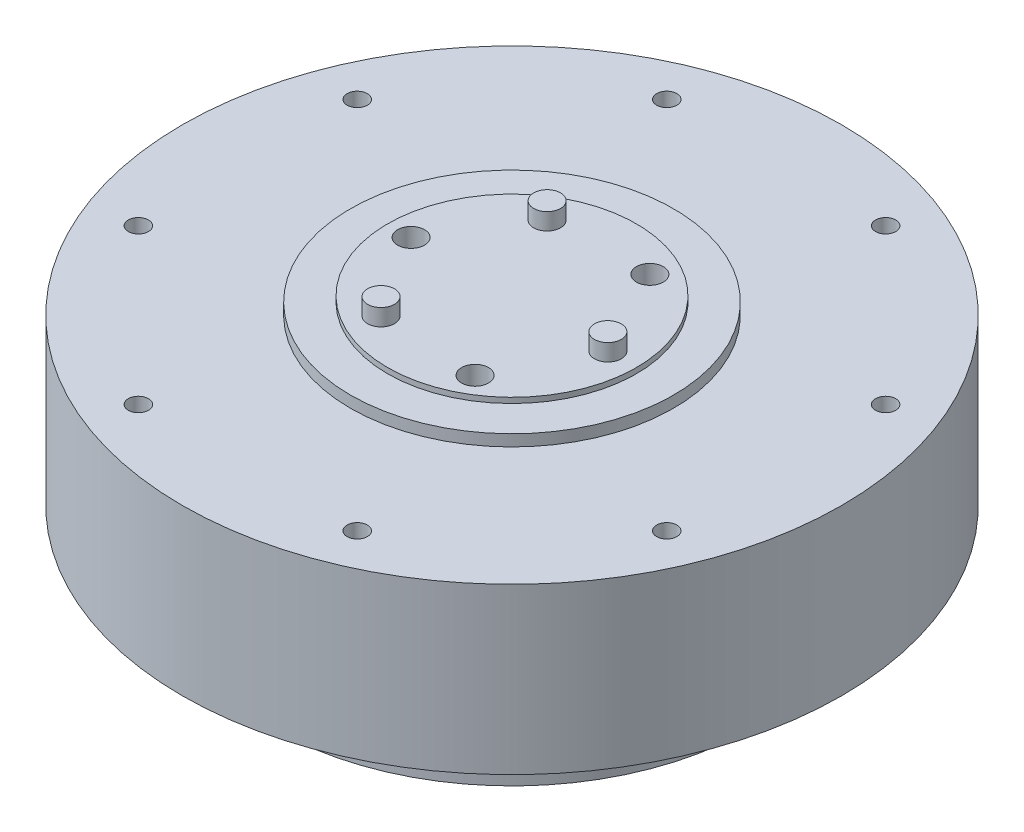
ISO-10303-21;
HEADER;
FILE_DESCRIPTION(('STEP AP214'),'2;1');
FILE_NAME('part.step','',(''),(''),'','','');
FILE_SCHEMA(('AUTOMOTIVE_DESIGN { 1 0 10303 214 1 1 1 1 }'));
ENDSEC;
DATA;
#1=APPLICATION_CONTEXT('core data for automotive mechanical design processes');
#2=APPLICATION_PROTOCOL_DEFINITION('international standard','automotive_design',2000,#1);
#3=PRODUCT_CONTEXT('',#1,'mechanical');
#4=PRODUCT('Part','Part','',(#3));
#5=PRODUCT_RELATED_PRODUCT_CATEGORY('part','',(#4));
#6=PRODUCT_DEFINITION_FORMATION('','',#4);
#7=PRODUCT_DEFINITION_CONTEXT('part definition',#1,'design');
#8=PRODUCT_DEFINITION('design','',#6,#7);
#9=PRODUCT_DEFINITION_SHAPE('','',#8);
#10=(LENGTH_UNIT() NAMED_UNIT(*) SI_UNIT(.MILLI.,.METRE.));
#11=(NAMED_UNIT(*) PLANE_ANGLE_UNIT() SI_UNIT($,.RADIAN.));
#12=(NAMED_UNIT(*) SI_UNIT($,.STERADIAN.) SOLID_ANGLE_UNIT());
#13=UNCERTAINTY_MEASURE_WITH_UNIT(LENGTH_MEASURE(1.E-05),#10,'distance_accuracy_value','');
#14=(GEOMETRIC_REPRESENTATION_CONTEXT(3) GLOBAL_UNCERTAINTY_ASSIGNED_CONTEXT((#13)) GLOBAL_UNIT_ASSIGNED_CONTEXT((#10,
#11,#12)) REPRESENTATION_CONTEXT('',''));
#15=CARTESIAN_POINT('',(0.,0.,0.));
#16=DIRECTION('',(0.,0.,1.));
#17=DIRECTION('',(1.,0.,0.));
#18=AXIS2_PLACEMENT_3D('',#15,#16,#17);
#19=CARTESIAN_POINT('',(0.,24.5,0.));
#20=DIRECTION('',(0.,-1.,0.));
#21=DIRECTION('',(0.,0.,-1.));
#22=AXIS2_PLACEMENT_3D('',#19,#20,#21);
#23=CYLINDRICAL_SURFACE('',#22,49.);
#24=CARTESIAN_POINT('',(0.,24.5,0.));
#25=DIRECTION('',(0.,1.,0.));
#26=DIRECTION('',(0.,0.,1.));
#27=AXIS2_PLACEMENT_3D('',#24,#25,#26);
#28=CIRCLE('',#27,49.);
#29=CARTESIAN_POINT('',(0.,24.5,49.));
#30=VERTEX_POINT('',#29);
#31=EDGE_CURVE('E181',#30,#30,#28,.T.);
#32=ORIENTED_EDGE('',*,*,#31,.F.);
#33=EDGE_LOOP('',(#32));
#34=FACE_BOUND('',#33,.T.);
#35=CARTESIAN_POINT('',(0.,0.,0.));
#36=DIRECTION('',(0.,1.,0.));
#37=DIRECTION('',(0.,0.,1.));
#38=AXIS2_PLACEMENT_3D('',#35,#36,#37);
#39=CIRCLE('',#38,49.);
#40=CARTESIAN_POINT('',(0.,0.,49.));
#41=VERTEX_POINT('',#40);
#42=EDGE_CURVE('E51',#41,#41,#39,.T.);
#43=ORIENTED_EDGE('',*,*,#42,.T.);
#44=EDGE_LOOP('',(#43));
#45=FACE_BOUND('',#44,.T.);
#46=ADVANCED_FACE('F48',(#34,#45),#23,.T.);
#47=CARTESIAN_POINT('',(0.,24.5,0.));
#48=DIRECTION('',(0.,1.,0.));
#49=DIRECTION('',(0.,0.,1.));
#50=AXIS2_PLACEMENT_3D('',#47,#48,#49);
#51=PLANE('',#50);
#52=CARTESIAN_POINT('',(16.2640458755165,24.5,39.2648801317296));
#53=DIRECTION('',(0.,1.,0.));
#54=DIRECTION('',(0.,0.,1.));
#55=AXIS2_PLACEMENT_3D('',#52,#53,#54);
#56=CIRCLE('',#55,1.49999999999999);
#57=CARTESIAN_POINT('',(16.2640458755165,24.5,40.7648801317296));
#58=VERTEX_POINT('',#57);
#59=EDGE_CURVE('E813',#58,#58,#56,.T.);
#60=ORIENTED_EDGE('',*,*,#59,.F.);
#61=EDGE_LOOP('',(#60));
#62=FACE_BOUND('',#61,.T.);
#63=CARTESIAN_POINT('',(-16.2640458755162,24.5,39.2648801317297));
#64=DIRECTION('',(0.,1.,0.));
#65=DIRECTION('',(0.,0.,1.));
#66=AXIS2_PLACEMENT_3D('',#63,#64,#65);
#67=CIRCLE('',#66,1.49999999999999);
#68=CARTESIAN_POINT('',(-16.2640458755162,24.5,40.7648801317297));
#69=VERTEX_POINT('',#68);
#70=EDGE_CURVE('E819',#69,#69,#67,.T.);
#71=ORIENTED_EDGE('',*,*,#70,.F.);
#72=EDGE_LOOP('',(#71));
#73=FACE_BOUND('',#72,.T.);
#74=CARTESIAN_POINT('',(-39.2648801317297,24.5,16.2640458755163));
#75=DIRECTION('',(0.,1.,0.));
#76=DIRECTION('',(0.,0.,1.));
#77=AXIS2_PLACEMENT_3D('',#74,#75,#76);
#78=CIRCLE('',#77,1.49999999999999);
#79=CARTESIAN_POINT('',(-39.2648801317297,24.5,17.7640458755163));
#80=VERTEX_POINT('',#79);
#81=EDGE_CURVE('E825',#80,#80,#78,.T.);
#82=ORIENTED_EDGE('',*,*,#81,.F.);
#83=EDGE_LOOP('',(#82));
#84=FACE_BOUND('',#83,.T.);
#85=CARTESIAN_POINT('',(-39.2648801317299,24.5,-16.2640458755158));
#86=DIRECTION('',(0.,1.,0.));
#87=DIRECTION('',(0.,0.,1.));
#88=AXIS2_PLACEMENT_3D('',#85,#86,#87);
#89=CIRCLE('',#88,1.49999999999999);
#90=CARTESIAN_POINT('',(-39.2648801317299,24.5,-14.7640458755158));
#91=VERTEX_POINT('',#90);
#92=EDGE_CURVE('E794',#91,#91,#89,.T.);
#93=ORIENTED_EDGE('',*,*,#92,.F.);
#94=EDGE_LOOP('',(#93));
#95=FACE_BOUND('',#94,.T.);
#96=CARTESIAN_POINT('',(-16.2640458755168,24.5,-39.2648801317295));
#97=DIRECTION('',(0.,1.,0.));
#98=DIRECTION('',(0.,0.,1.));
#99=AXIS2_PLACEMENT_3D('',#96,#97,#98);
#100=CIRCLE('',#99,1.49999999999999);
#101=CARTESIAN_POINT('',(-16.2640458755168,24.5,-37.7648801317295));
#102=VERTEX_POINT('',#101);
#103=EDGE_CURVE('E795',#102,#102,#100,.T.);
#104=ORIENTED_EDGE('',*,*,#103,.F.);
#105=EDGE_LOOP('',(#104));
#106=FACE_BOUND('',#105,.T.);
#107=CARTESIAN_POINT('',(16.2640458755159,24.5,-39.2648801317298));
#108=DIRECTION('',(0.,1.,0.));
#109=DIRECTION('',(0.,0.,1.));
#110=AXIS2_PLACEMENT_3D('',#107,#108,#109);
#111=CIRCLE('',#110,1.49999999999999);
#112=CARTESIAN_POINT('',(16.2640458755159,24.5,-37.7648801317299));
#113=VERTEX_POINT('',#112);
#114=EDGE_CURVE('E801',#113,#113,#111,.T.);
#115=ORIENTED_EDGE('',*,*,#114,.F.);
#116=EDGE_LOOP('',(#115));
#117=FACE_BOUND('',#116,.T.);
#118=CARTESIAN_POINT('',(39.2648801317297,24.5,-16.2640458755163));
#119=DIRECTION('',(0.,1.,0.));
#120=DIRECTION('',(0.,0.,1.));
#121=AXIS2_PLACEMENT_3D('',#118,#119,#120);
#122=CIRCLE('',#121,1.49999999999999);
#123=CARTESIAN_POINT('',(39.2648801317297,24.5,-14.7640458755164));
#124=VERTEX_POINT('',#123);
#125=EDGE_CURVE('E788',#124,#124,#122,.T.);
#126=ORIENTED_EDGE('',*,*,#125,.F.);
#127=EDGE_LOOP('',(#126));
#128=FACE_BOUND('',#127,.T.);
#129=CARTESIAN_POINT('',(39.2648801317298,24.5,16.2640458755161));
#130=DIRECTION('',(0.,1.,0.));
#131=DIRECTION('',(0.,0.,1.));
#132=AXIS2_PLACEMENT_3D('',#129,#130,#131);
#133=CIRCLE('',#132,1.49999999999999);
#134=CARTESIAN_POINT('',(39.2648801317298,24.5,17.7640458755161));
#135=VERTEX_POINT('',#134);
#136=EDGE_CURVE('E812',#135,#135,#133,.T.);
#137=ORIENTED_EDGE('',*,*,#136,.F.);
#138=EDGE_LOOP('',(#137));
#139=FACE_BOUND('',#138,.T.);
#140=CARTESIAN_POINT('',(0.,24.5,0.));
#141=DIRECTION('',(0.,1.,0.));
#142=DIRECTION('',(0.,0.,1.));
#143=AXIS2_PLACEMENT_3D('',#140,#141,#142);
#144=CIRCLE('',#143,24.);
#145=CARTESIAN_POINT('',(0.,24.5,24.));
#146=VERTEX_POINT('',#145);
#147=EDGE_CURVE('E177',#146,#146,#144,.T.);
#148=ORIENTED_EDGE('',*,*,#147,.F.);
#149=EDGE_LOOP('',(#148));
#150=FACE_BOUND('',#149,.T.);
#151=ORIENTED_EDGE('',*,*,#31,.T.);
#152=EDGE_LOOP('',(#151));
#153=FACE_BOUND('',#152,.T.);
#154=ADVANCED_FACE('F192',(#62,#73,#84,#95,#106,#117,#128,#139,#150,#153),#51,.T.);
#155=CARTESIAN_POINT('',(0.,0.,0.));
#156=DIRECTION('',(0.,1.,0.));
#157=DIRECTION('',(0.,0.,1.));
#158=AXIS2_PLACEMENT_3D('',#155,#156,#157);
#159=PLANE('',#158);
#160=CARTESIAN_POINT('',(-39.2648801317299,0.,-16.2640458755158));
#161=DIRECTION('',(0.,-1.,0.));
#162=DIRECTION('',(0.,0.,-1.));
#163=AXIS2_PLACEMENT_3D('',#160,#161,#162);
#164=CIRCLE('',#163,1.49999999999999);
#165=CARTESIAN_POINT('',(-39.2648801317299,0.,-17.7640458755158));
#166=VERTEX_POINT('',#165);
#167=EDGE_CURVE('E120',#166,#166,#164,.T.);
#168=ORIENTED_EDGE('',*,*,#167,.F.);
#169=EDGE_LOOP('',(#168));
#170=FACE_BOUND('',#169,.T.);
#171=CARTESIAN_POINT('',(-16.2640458755168,0.,-39.2648801317295));
#172=DIRECTION('',(0.,-1.,0.));
#173=DIRECTION('',(0.,0.,-1.));
#174=AXIS2_PLACEMENT_3D('',#171,#172,#173);
#175=CIRCLE('',#174,1.49999999999999);
#176=CARTESIAN_POINT('',(-16.2640458755168,0.,-40.7648801317295));
#177=VERTEX_POINT('',#176);
#178=EDGE_CURVE('E126',#177,#177,#175,.T.);
#179=ORIENTED_EDGE('',*,*,#178,.F.);
#180=EDGE_LOOP('',(#179));
#181=FACE_BOUND('',#180,.T.);
#182=CARTESIAN_POINT('',(16.2640458755159,0.,-39.2648801317298));
#183=DIRECTION('',(0.,-1.,0.));
#184=DIRECTION('',(0.,0.,-1.));
#185=AXIS2_PLACEMENT_3D('',#182,#183,#184);
#186=CIRCLE('',#185,1.49999999999999);
#187=CARTESIAN_POINT('',(16.2640458755159,0.,-40.7648801317298));
#188=VERTEX_POINT('',#187);
#189=EDGE_CURVE('E132',#188,#188,#186,.T.);
#190=ORIENTED_EDGE('',*,*,#189,.F.);
#191=EDGE_LOOP('',(#190));
#192=FACE_BOUND('',#191,.T.);
#193=CARTESIAN_POINT('',(39.2648801317297,0.,-16.2640458755163));
#194=DIRECTION('',(0.,-1.,0.));
#195=DIRECTION('',(0.,0.,-1.));
#196=AXIS2_PLACEMENT_3D('',#193,#194,#195);
#197=CIRCLE('',#196,1.49999999999999);
#198=CARTESIAN_POINT('',(39.2648801317297,0.,-17.7640458755163));
#199=VERTEX_POINT('',#198);
#200=EDGE_CURVE('E138',#199,#199,#197,.T.);
#201=ORIENTED_EDGE('',*,*,#200,.F.);
#202=EDGE_LOOP('',(#201));
#203=FACE_BOUND('',#202,.T.);
#204=CARTESIAN_POINT('',(39.2648801317298,0.,16.2640458755161));
#205=DIRECTION('',(0.,-1.,0.));
#206=DIRECTION('',(0.,0.,-1.));
#207=AXIS2_PLACEMENT_3D('',#204,#205,#206);
#208=CIRCLE('',#207,1.49999999999999);
#209=CARTESIAN_POINT('',(39.2648801317298,0.,14.7640458755161));
#210=VERTEX_POINT('',#209);
#211=EDGE_CURVE('E144',#210,#210,#208,.T.);
#212=ORIENTED_EDGE('',*,*,#211,.F.);
#213=EDGE_LOOP('',(#212));
#214=FACE_BOUND('',#213,.T.);
#215=CARTESIAN_POINT('',(16.2640458755165,0.,39.2648801317296));
#216=DIRECTION('',(0.,-1.,0.));
#217=DIRECTION('',(0.,0.,-1.));
#218=AXIS2_PLACEMENT_3D('',#215,#216,#217);
#219=CIRCLE('',#218,1.49999999999999);
#220=CARTESIAN_POINT('',(16.2640458755165,0.,37.7648801317296));
#221=VERTEX_POINT('',#220);
#222=EDGE_CURVE('E150',#221,#221,#219,.T.);
#223=ORIENTED_EDGE('',*,*,#222,.F.);
#224=EDGE_LOOP('',(#223));
#225=FACE_BOUND('',#224,.T.);
#226=CARTESIAN_POINT('',(-16.2640458755162,0.,39.2648801317297));
#227=DIRECTION('',(0.,-1.,0.));
#228=DIRECTION('',(0.,0.,-1.));
#229=AXIS2_PLACEMENT_3D('',#226,#227,#228);
#230=CIRCLE('',#229,1.49999999999999);
#231=CARTESIAN_POINT('',(-16.2640458755162,0.,37.7648801317298));
#232=VERTEX_POINT('',#231);
#233=EDGE_CURVE('E156',#232,#232,#230,.T.);
#234=ORIENTED_EDGE('',*,*,#233,.F.);
#235=EDGE_LOOP('',(#234));
#236=FACE_BOUND('',#235,.T.);
#237=CARTESIAN_POINT('',(-39.2648801317297,0.,16.2640458755163));
#238=DIRECTION('',(0.,-1.,0.));
#239=DIRECTION('',(0.,0.,-1.));
#240=AXIS2_PLACEMENT_3D('',#237,#238,#239);
#241=CIRCLE('',#240,1.49999999999999);
#242=CARTESIAN_POINT('',(-39.2648801317297,0.,14.7640458755164));
#243=VERTEX_POINT('',#242);
#244=EDGE_CURVE('E162',#243,#243,#241,.T.);
#245=ORIENTED_EDGE('',*,*,#244,.F.);
#246=EDGE_LOOP('',(#245));
#247=FACE_BOUND('',#246,.T.);
#248=CARTESIAN_POINT('',(0.,0.,0.));
#249=DIRECTION('',(0.,-1.,0.));
#250=DIRECTION('',(0.,0.,-1.));
#251=AXIS2_PLACEMENT_3D('',#248,#249,#250);
#252=CIRCLE('',#251,35.5);
#253=CARTESIAN_POINT('',(0.,0.,-35.5));
#254=VERTEX_POINT('',#253);
#255=EDGE_CURVE('E13',#254,#254,#252,.T.);
#256=ORIENTED_EDGE('',*,*,#255,.F.);
#257=EDGE_LOOP('',(#256));
#258=FACE_BOUND('',#257,.T.);
#259=ORIENTED_EDGE('',*,*,#42,.F.);
#260=EDGE_LOOP('',(#259));
#261=FACE_BOUND('',#260,.T.);
#262=ADVANCED_FACE('F189',(#170,#181,#192,#203,#214,#225,#236,#247,#258,#261),#159,.F.);
#263=CARTESIAN_POINT('',(0.,26.2,0.));
#264=DIRECTION('',(0.,-1.,0.));
#265=DIRECTION('',(0.,0.,-1.));
#266=AXIS2_PLACEMENT_3D('',#263,#264,#265);
#267=CYLINDRICAL_SURFACE('',#266,24.);
#268=CARTESIAN_POINT('',(0.,26.2,0.));
#269=DIRECTION('',(0.,1.,0.));
#270=DIRECTION('',(0.,0.,1.));
#271=AXIS2_PLACEMENT_3D('',#268,#269,#270);
#272=CIRCLE('',#271,24.);
#273=CARTESIAN_POINT('',(0.,26.2,24.));
#274=VERTEX_POINT('',#273);
#275=EDGE_CURVE('E174',#274,#274,#272,.T.);
#276=ORIENTED_EDGE('',*,*,#275,.F.);
#277=EDGE_LOOP('',(#276));
#278=FACE_BOUND('',#277,.T.);
#279=ORIENTED_EDGE('',*,*,#147,.T.);
#280=EDGE_LOOP('',(#279));
#281=FACE_BOUND('',#280,.T.);
#282=ADVANCED_FACE('F191',(#278,#281),#267,.T.);
#283=CARTESIAN_POINT('',(0.,26.2,0.));
#284=DIRECTION('',(0.,1.,0.));
#285=DIRECTION('',(0.,0.,1.));
#286=AXIS2_PLACEMENT_3D('',#283,#284,#285);
#287=PLANE('',#286);
#288=CARTESIAN_POINT('',(0.,26.2,0.));
#289=DIRECTION('',(0.,1.,0.));
#290=DIRECTION('',(0.,0.,1.));
#291=AXIS2_PLACEMENT_3D('',#288,#289,#290);
#292=CIRCLE('',#291,18.5);
#293=CARTESIAN_POINT('',(0.,26.2,18.5));
#294=VERTEX_POINT('',#293);
#295=EDGE_CURVE('E56',#294,#294,#292,.T.);
#296=ORIENTED_EDGE('',*,*,#295,.F.);
#297=EDGE_LOOP('',(#296));
#298=FACE_BOUND('',#297,.T.);
#299=ORIENTED_EDGE('',*,*,#275,.T.);
#300=EDGE_LOOP('',(#299));
#301=FACE_BOUND('',#300,.T.);
#302=ADVANCED_FACE('F198',(#298,#301),#287,.T.);
#303=CARTESIAN_POINT('',(0.,27.,0.));
#304=DIRECTION('',(0.,-1.,0.));
#305=DIRECTION('',(0.,0.,-1.));
#306=AXIS2_PLACEMENT_3D('',#303,#304,#305);
#307=CYLINDRICAL_SURFACE('',#306,18.5);
#308=CARTESIAN_POINT('',(0.,27.,0.));
#309=DIRECTION('',(0.,1.,0.));
#310=DIRECTION('',(0.,0.,1.));
#311=AXIS2_PLACEMENT_3D('',#308,#309,#310);
#312=CIRCLE('',#311,18.5);
#313=CARTESIAN_POINT('',(0.,27.,18.5));
#314=VERTEX_POINT('',#313);
#315=EDGE_CURVE('E170',#314,#314,#312,.T.);
#316=ORIENTED_EDGE('',*,*,#315,.F.);
#317=EDGE_LOOP('',(#316));
#318=FACE_BOUND('',#317,.T.);
#319=ORIENTED_EDGE('',*,*,#295,.T.);
#320=EDGE_LOOP('',(#319));
#321=FACE_BOUND('',#320,.T.);
#322=ADVANCED_FACE('F414',(#318,#321),#307,.T.);
#323=CARTESIAN_POINT('',(0.,27.,0.));
#324=DIRECTION('',(0.,1.,0.));
#325=DIRECTION('',(0.,0.,1.));
#326=AXIS2_PLACEMENT_3D('',#323,#324,#325);
#327=PLANE('',#326);
#328=CARTESIAN_POINT('',(14.25,27.,-2.05564731903252E-13));
#329=DIRECTION('',(0.,1.,0.));
#330=DIRECTION('',(-0.866025403784443,0.,-0.499999999999992));
#331=AXIS2_PLACEMENT_3D('',#328,#329,#330);
#332=CIRCLE('',#331,2.);
#333=CARTESIAN_POINT('',(12.5179491924311,27.,-1.00000000000019));
#334=VERTEX_POINT('',#333);
#335=EDGE_CURVE('E774',#334,#334,#332,.T.);
#336=ORIENTED_EDGE('',*,*,#335,.F.);
#337=EDGE_LOOP('',(#336));
#338=FACE_BOUND('',#337,.T.);
#339=CARTESIAN_POINT('',(-7.12499999999988,27.,12.3408620039283));
#340=DIRECTION('',(0.,1.,0.));
#341=DIRECTION('',(0.866025403784436,0.,-0.500000000000004));
#342=AXIS2_PLACEMENT_3D('',#339,#340,#341);
#343=CIRCLE('',#342,2.);
#344=CARTESIAN_POINT('',(-5.39294919243101,27.,11.3408620039283));
#345=VERTEX_POINT('',#344);
#346=EDGE_CURVE('E773',#345,#345,#343,.T.);
#347=ORIENTED_EDGE('',*,*,#346,.F.);
#348=EDGE_LOOP('',(#347));
#349=FACE_BOUND('',#348,.T.);
#350=CARTESIAN_POINT('',(-7.12500000000006,27.,-12.3408620039282));
#351=DIRECTION('',(0.,1.,0.));
#352=DIRECTION('',(0.,0.,1.));
#353=AXIS2_PLACEMENT_3D('',#350,#351,#352);
#354=CIRCLE('',#353,2.);
#355=CARTESIAN_POINT('',(-7.12500000000006,27.,-10.3408620039282));
#356=VERTEX_POINT('',#355);
#357=EDGE_CURVE('E783',#356,#356,#354,.T.);
#358=ORIENTED_EDGE('',*,*,#357,.F.);
#359=EDGE_LOOP('',(#358));
#360=FACE_BOUND('',#359,.T.);
#361=CARTESIAN_POINT('',(7.49999999999988,27.,-12.9903810567666));
#362=DIRECTION('',(0.,1.,0.));
#363=DIRECTION('',(0.,0.,1.));
#364=AXIS2_PLACEMENT_3D('',#361,#362,#363);
#365=CIRCLE('',#364,2.);
#366=CARTESIAN_POINT('',(7.49999999999988,27.,-10.9903810567667));
#367=VERTEX_POINT('',#366);
#368=EDGE_CURVE('E102',#367,#367,#365,.T.);
#369=ORIENTED_EDGE('',*,*,#368,.F.);
#370=EDGE_LOOP('',(#369));
#371=FACE_BOUND('',#370,.T.);
#372=CARTESIAN_POINT('',(7.50000000000006,27.,12.9903810567665));
#373=DIRECTION('',(0.,1.,0.));
#374=DIRECTION('',(0.,0.,1.));
#375=AXIS2_PLACEMENT_3D('',#372,#373,#374);
#376=CIRCLE('',#375,2.);
#377=CARTESIAN_POINT('',(7.50000000000006,27.,14.9903810567665));
#378=VERTEX_POINT('',#377);
#379=EDGE_CURVE('E101',#378,#378,#376,.T.);
#380=ORIENTED_EDGE('',*,*,#379,.F.);
#381=EDGE_LOOP('',(#380));
#382=FACE_BOUND('',#381,.T.);
#383=CARTESIAN_POINT('',(-15.,27.,0.));
#384=DIRECTION('',(0.,1.,0.));
#385=DIRECTION('',(0.,0.,1.));
#386=AXIS2_PLACEMENT_3D('',#383,#384,#385);
#387=CIRCLE('',#386,2.);
#388=CARTESIAN_POINT('',(-15.,27.,2.));
#389=VERTEX_POINT('',#388);
#390=EDGE_CURVE('E114',#389,#389,#387,.T.);
#391=ORIENTED_EDGE('',*,*,#390,.F.);
#392=EDGE_LOOP('',(#391));
#393=FACE_BOUND('',#392,.T.);
#394=ORIENTED_EDGE('',*,*,#315,.T.);
#395=EDGE_LOOP('',(#394));
#396=FACE_BOUND('',#395,.T.);
#397=ADVANCED_FACE('F408',(#338,#349,#360,#371,#382,#393,#396),#327,.T.);
#398=CARTESIAN_POINT('',(0.,-11.,0.));
#399=DIRECTION('',(0.,1.,0.));
#400=DIRECTION('',(0.,0.,1.));
#401=AXIS2_PLACEMENT_3D('',#398,#399,#400);
#402=CYLINDRICAL_SURFACE('',#401,35.5);
#403=CARTESIAN_POINT('',(0.,-11.,0.));
#404=DIRECTION('',(0.,-1.,0.));
#405=DIRECTION('',(0.,0.,-1.));
#406=AXIS2_PLACEMENT_3D('',#403,#404,#405);
#407=CIRCLE('',#406,35.5);
#408=CARTESIAN_POINT('',(0.,-11.,-35.5));
#409=VERTEX_POINT('',#408);
#410=EDGE_CURVE('E168',#409,#409,#407,.T.);
#411=ORIENTED_EDGE('',*,*,#410,.F.);
#412=EDGE_LOOP('',(#411));
#413=FACE_BOUND('',#412,.T.);
#414=ORIENTED_EDGE('',*,*,#255,.T.);
#415=EDGE_LOOP('',(#414));
#416=FACE_BOUND('',#415,.T.);
#417=ADVANCED_FACE('F413',(#413,#416),#402,.T.);
#418=CARTESIAN_POINT('',(0.,-11.,0.));
#419=DIRECTION('',(0.,-1.,0.));
#420=DIRECTION('',(0.,0.,-1.));
#421=AXIS2_PLACEMENT_3D('',#418,#419,#420);
#422=PLANE('',#421);
#423=ORIENTED_EDGE('',*,*,#410,.T.);
#424=EDGE_LOOP('',(#423));
#425=FACE_BOUND('',#424,.T.);
#426=ADVANCED_FACE('F540',(#425),#422,.T.);
#427=CARTESIAN_POINT('',(-39.2648801317297,3.,16.2640458755163));
#428=DIRECTION('',(0.,-1.,0.));
#429=DIRECTION('',(0.,0.,-1.));
#430=AXIS2_PLACEMENT_3D('',#427,#428,#429);
#431=CONICAL_SURFACE('',#430,1.49999999999999,1.02974425867665);
#432=CARTESIAN_POINT('',(-39.2648801317297,3.90129092854134,16.2640458755163));
#433=VERTEX_POINT('',#432);
#434=VERTEX_LOOP('',#433);
#435=FACE_BOUND('',#434,.T.);
#436=CARTESIAN_POINT('',(-39.2648801317297,3.,16.2640458755163));
#437=DIRECTION('',(0.,-1.,0.));
#438=DIRECTION('',(0.,0.,-1.));
#439=AXIS2_PLACEMENT_3D('',#436,#437,#438);
#440=CIRCLE('',#439,1.49999999999999);
#441=CARTESIAN_POINT('',(-39.2648801317297,3.,14.7640458755164));
#442=VERTEX_POINT('',#441);
#443=EDGE_CURVE('E165',#442,#442,#440,.T.);
#444=ORIENTED_EDGE('',*,*,#443,.T.);
#445=EDGE_LOOP('',(#444));
#446=FACE_BOUND('',#445,.T.);
#447=ADVANCED_FACE('F536',(#435,#446),#431,.F.);
#448=CARTESIAN_POINT('',(-39.2648801317297,0.,16.2640458755163));
#449=DIRECTION('',(0.,-1.,0.));
#450=DIRECTION('',(0.,0.,-1.));
#451=AXIS2_PLACEMENT_3D('',#448,#449,#450);
#452=CYLINDRICAL_SURFACE('',#451,1.49999999999999);
#453=ORIENTED_EDGE('',*,*,#443,.F.);
#454=EDGE_LOOP('',(#453));
#455=FACE_BOUND('',#454,.T.);
#456=ORIENTED_EDGE('',*,*,#244,.T.);
#457=EDGE_LOOP('',(#456));
#458=FACE_BOUND('',#457,.T.);
#459=ADVANCED_FACE('F533',(#455,#458),#452,.F.);
#460=CARTESIAN_POINT('',(-16.2640458755162,3.,39.2648801317297));
#461=DIRECTION('',(0.,-1.,0.));
#462=DIRECTION('',(0.,0.,-1.));
#463=AXIS2_PLACEMENT_3D('',#460,#461,#462);
#464=CONICAL_SURFACE('',#463,1.5,1.02974425867665);
#465=CARTESIAN_POINT('',(-16.2640458755162,3.90129092854134,39.2648801317297));
#466=VERTEX_POINT('',#465);
#467=VERTEX_LOOP('',#466);
#468=FACE_BOUND('',#467,.T.);
#469=CARTESIAN_POINT('',(-16.2640458755162,3.,39.2648801317297));
#470=DIRECTION('',(0.,-1.,0.));
#471=DIRECTION('',(0.,0.,-1.));
#472=AXIS2_PLACEMENT_3D('',#469,#470,#471);
#473=CIRCLE('',#472,1.5);
#474=CARTESIAN_POINT('',(-16.2640458755162,3.,37.7648801317297));
#475=VERTEX_POINT('',#474);
#476=EDGE_CURVE('E159',#475,#475,#473,.T.);
#477=ORIENTED_EDGE('',*,*,#476,.T.);
#478=EDGE_LOOP('',(#477));
#479=FACE_BOUND('',#478,.T.);
#480=ADVANCED_FACE('F529',(#468,#479),#464,.F.);
#481=CARTESIAN_POINT('',(-16.2640458755162,0.,39.2648801317297));
#482=DIRECTION('',(0.,-1.,0.));
#483=DIRECTION('',(0.,0.,-1.));
#484=AXIS2_PLACEMENT_3D('',#481,#482,#483);
#485=CYLINDRICAL_SURFACE('',#484,1.49999999999999);
#486=ORIENTED_EDGE('',*,*,#476,.F.);
#487=EDGE_LOOP('',(#486));
#488=FACE_BOUND('',#487,.T.);
#489=ORIENTED_EDGE('',*,*,#233,.T.);
#490=EDGE_LOOP('',(#489));
#491=FACE_BOUND('',#490,.T.);
#492=ADVANCED_FACE('F525',(#488,#491),#485,.F.);
#493=CARTESIAN_POINT('',(16.2640458755165,3.,39.2648801317296));
#494=DIRECTION('',(0.,-1.,0.));
#495=DIRECTION('',(0.,0.,-1.));
#496=AXIS2_PLACEMENT_3D('',#493,#494,#495);
#497=CONICAL_SURFACE('',#496,1.5,1.02974425867665);
#498=CARTESIAN_POINT('',(16.2640458755165,3.90129092854134,39.2648801317296));
#499=VERTEX_POINT('',#498);
#500=VERTEX_LOOP('',#499);
#501=FACE_BOUND('',#500,.T.);
#502=CARTESIAN_POINT('',(16.2640458755165,3.,39.2648801317296));
#503=DIRECTION('',(0.,-1.,0.));
#504=DIRECTION('',(0.,0.,-1.));
#505=AXIS2_PLACEMENT_3D('',#502,#503,#504);
#506=CIRCLE('',#505,1.5);
#507=CARTESIAN_POINT('',(16.2640458755165,3.,37.7648801317296));
#508=VERTEX_POINT('',#507);
#509=EDGE_CURVE('E153',#508,#508,#506,.T.);
#510=ORIENTED_EDGE('',*,*,#509,.T.);
#511=EDGE_LOOP('',(#510));
#512=FACE_BOUND('',#511,.T.);
#513=ADVANCED_FACE('F521',(#501,#512),#497,.F.);
#514=CARTESIAN_POINT('',(16.2640458755165,0.,39.2648801317296));
#515=DIRECTION('',(0.,-1.,0.));
#516=DIRECTION('',(0.,0.,-1.));
#517=AXIS2_PLACEMENT_3D('',#514,#515,#516);
#518=CYLINDRICAL_SURFACE('',#517,1.49999999999999);
#519=ORIENTED_EDGE('',*,*,#509,.F.);
#520=EDGE_LOOP('',(#519));
#521=FACE_BOUND('',#520,.T.);
#522=ORIENTED_EDGE('',*,*,#222,.T.);
#523=EDGE_LOOP('',(#522));
#524=FACE_BOUND('',#523,.T.);
#525=ADVANCED_FACE('F517',(#521,#524),#518,.F.);
#526=CARTESIAN_POINT('',(39.2648801317298,3.,16.2640458755161));
#527=DIRECTION('',(0.,-1.,0.));
#528=DIRECTION('',(0.,0.,-1.));
#529=AXIS2_PLACEMENT_3D('',#526,#527,#528);
#530=CONICAL_SURFACE('',#529,1.49999999999999,1.02974425867665);
#531=CARTESIAN_POINT('',(39.2648801317298,3.90129092854134,16.2640458755161));
#532=VERTEX_POINT('',#531);
#533=VERTEX_LOOP('',#532);
#534=FACE_BOUND('',#533,.T.);
#535=CARTESIAN_POINT('',(39.2648801317298,3.,16.2640458755161));
#536=DIRECTION('',(0.,-1.,0.));
#537=DIRECTION('',(0.,0.,-1.));
#538=AXIS2_PLACEMENT_3D('',#535,#536,#537);
#539=CIRCLE('',#538,1.49999999999999);
#540=CARTESIAN_POINT('',(39.2648801317298,3.,14.7640458755161));
#541=VERTEX_POINT('',#540);
#542=EDGE_CURVE('E147',#541,#541,#539,.T.);
#543=ORIENTED_EDGE('',*,*,#542,.T.);
#544=EDGE_LOOP('',(#543));
#545=FACE_BOUND('',#544,.T.);
#546=ADVANCED_FACE('F513',(#534,#545),#530,.F.);
#547=CARTESIAN_POINT('',(39.2648801317298,0.,16.2640458755161));
#548=DIRECTION('',(0.,-1.,0.));
#549=DIRECTION('',(0.,0.,-1.));
#550=AXIS2_PLACEMENT_3D('',#547,#548,#549);
#551=CYLINDRICAL_SURFACE('',#550,1.49999999999999);
#552=ORIENTED_EDGE('',*,*,#542,.F.);
#553=EDGE_LOOP('',(#552));
#554=FACE_BOUND('',#553,.T.);
#555=ORIENTED_EDGE('',*,*,#211,.T.);
#556=EDGE_LOOP('',(#555));
#557=FACE_BOUND('',#556,.T.);
#558=ADVANCED_FACE('F509',(#554,#557),#551,.F.);
#559=CARTESIAN_POINT('',(39.2648801317297,3.,-16.2640458755163));
#560=DIRECTION('',(0.,-1.,0.));
#561=DIRECTION('',(0.,0.,-1.));
#562=AXIS2_PLACEMENT_3D('',#559,#560,#561);
#563=CONICAL_SURFACE('',#562,1.49999999999999,1.02974425867665);
#564=CARTESIAN_POINT('',(39.2648801317297,3.90129092854134,-16.2640458755163));
#565=VERTEX_POINT('',#564);
#566=VERTEX_LOOP('',#565);
#567=FACE_BOUND('',#566,.T.);
#568=CARTESIAN_POINT('',(39.2648801317297,3.,-16.2640458755163));
#569=DIRECTION('',(0.,-1.,0.));
#570=DIRECTION('',(0.,0.,-1.));
#571=AXIS2_PLACEMENT_3D('',#568,#569,#570);
#572=CIRCLE('',#571,1.49999999999999);
#573=CARTESIAN_POINT('',(39.2648801317297,3.,-17.7640458755163));
#574=VERTEX_POINT('',#573);
#575=EDGE_CURVE('E141',#574,#574,#572,.T.);
#576=ORIENTED_EDGE('',*,*,#575,.T.);
#577=EDGE_LOOP('',(#576));
#578=FACE_BOUND('',#577,.T.);
#579=ADVANCED_FACE('F505',(#567,#578),#563,.F.);
#580=CARTESIAN_POINT('',(39.2648801317297,0.,-16.2640458755163));
#581=DIRECTION('',(0.,-1.,0.));
#582=DIRECTION('',(0.,0.,-1.));
#583=AXIS2_PLACEMENT_3D('',#580,#581,#582);
#584=CYLINDRICAL_SURFACE('',#583,1.49999999999999);
#585=ORIENTED_EDGE('',*,*,#575,.F.);
#586=EDGE_LOOP('',(#585));
#587=FACE_BOUND('',#586,.T.);
#588=ORIENTED_EDGE('',*,*,#200,.T.);
#589=EDGE_LOOP('',(#588));
#590=FACE_BOUND('',#589,.T.);
#591=ADVANCED_FACE('F501',(#587,#590),#584,.F.);
#592=CARTESIAN_POINT('',(16.2640458755159,3.,-39.2648801317298));
#593=DIRECTION('',(0.,-1.,0.));
#594=DIRECTION('',(0.,0.,-1.));
#595=AXIS2_PLACEMENT_3D('',#592,#593,#594);
#596=CONICAL_SURFACE('',#595,1.5,1.02974425867665);
#597=CARTESIAN_POINT('',(16.2640458755159,3.90129092854134,-39.2648801317298));
#598=VERTEX_POINT('',#597);
#599=VERTEX_LOOP('',#598);
#600=FACE_BOUND('',#599,.T.);
#601=CARTESIAN_POINT('',(16.2640458755159,3.,-39.2648801317298));
#602=DIRECTION('',(0.,-1.,0.));
#603=DIRECTION('',(0.,0.,-1.));
#604=AXIS2_PLACEMENT_3D('',#601,#602,#603);
#605=CIRCLE('',#604,1.5);
#606=CARTESIAN_POINT('',(16.2640458755159,3.,-40.7648801317298));
#607=VERTEX_POINT('',#606);
#608=EDGE_CURVE('E135',#607,#607,#605,.T.);
#609=ORIENTED_EDGE('',*,*,#608,.T.);
#610=EDGE_LOOP('',(#609));
#611=FACE_BOUND('',#610,.T.);
#612=ADVANCED_FACE('F497',(#600,#611),#596,.F.);
#613=CARTESIAN_POINT('',(16.2640458755159,0.,-39.2648801317298));
#614=DIRECTION('',(0.,-1.,0.));
#615=DIRECTION('',(0.,0.,-1.));
#616=AXIS2_PLACEMENT_3D('',#613,#614,#615);
#617=CYLINDRICAL_SURFACE('',#616,1.49999999999999);
#618=ORIENTED_EDGE('',*,*,#608,.F.);
#619=EDGE_LOOP('',(#618));
#620=FACE_BOUND('',#619,.T.);
#621=ORIENTED_EDGE('',*,*,#189,.T.);
#622=EDGE_LOOP('',(#621));
#623=FACE_BOUND('',#622,.T.);
#624=ADVANCED_FACE('F493',(#620,#623),#617,.F.);
#625=CARTESIAN_POINT('',(-16.2640458755168,3.,-39.2648801317295));
#626=DIRECTION('',(0.,-1.,0.));
#627=DIRECTION('',(0.,0.,-1.));
#628=AXIS2_PLACEMENT_3D('',#625,#626,#627);
#629=CONICAL_SURFACE('',#628,1.5,1.02974425867665);
#630=CARTESIAN_POINT('',(-16.2640458755168,3.90129092854134,-39.2648801317295));
#631=VERTEX_POINT('',#630);
#632=VERTEX_LOOP('',#631);
#633=FACE_BOUND('',#632,.T.);
#634=CARTESIAN_POINT('',(-16.2640458755168,3.,-39.2648801317295));
#635=DIRECTION('',(0.,-1.,0.));
#636=DIRECTION('',(0.,0.,-1.));
#637=AXIS2_PLACEMENT_3D('',#634,#635,#636);
#638=CIRCLE('',#637,1.5);
#639=CARTESIAN_POINT('',(-16.2640458755168,3.,-40.7648801317295));
#640=VERTEX_POINT('',#639);
#641=EDGE_CURVE('E129',#640,#640,#638,.T.);
#642=ORIENTED_EDGE('',*,*,#641,.T.);
#643=EDGE_LOOP('',(#642));
#644=FACE_BOUND('',#643,.T.);
#645=ADVANCED_FACE('F489',(#633,#644),#629,.F.);
#646=CARTESIAN_POINT('',(-16.2640458755168,0.,-39.2648801317295));
#647=DIRECTION('',(0.,-1.,0.));
#648=DIRECTION('',(0.,0.,-1.));
#649=AXIS2_PLACEMENT_3D('',#646,#647,#648);
#650=CYLINDRICAL_SURFACE('',#649,1.49999999999999);
#651=ORIENTED_EDGE('',*,*,#641,.F.);
#652=EDGE_LOOP('',(#651));
#653=FACE_BOUND('',#652,.T.);
#654=ORIENTED_EDGE('',*,*,#178,.T.);
#655=EDGE_LOOP('',(#654));
#656=FACE_BOUND('',#655,.T.);
#657=ADVANCED_FACE('F485',(#653,#656),#650,.F.);
#658=CARTESIAN_POINT('',(-39.2648801317299,3.,-16.2640458755158));
#659=DIRECTION('',(0.,-1.,0.));
#660=DIRECTION('',(0.,0.,-1.));
#661=AXIS2_PLACEMENT_3D('',#658,#659,#660);
#662=CONICAL_SURFACE('',#661,1.49999999999999,1.02974425867665);
#663=CARTESIAN_POINT('',(-39.2648801317299,3.90129092854134,-16.2640458755158));
#664=VERTEX_POINT('',#663);
#665=VERTEX_LOOP('',#664);
#666=FACE_BOUND('',#665,.T.);
#667=CARTESIAN_POINT('',(-39.2648801317299,3.,-16.2640458755158));
#668=DIRECTION('',(0.,-1.,0.));
#669=DIRECTION('',(0.,0.,-1.));
#670=AXIS2_PLACEMENT_3D('',#667,#668,#669);
#671=CIRCLE('',#670,1.49999999999999);
#672=CARTESIAN_POINT('',(-39.2648801317299,3.,-17.7640458755158));
#673=VERTEX_POINT('',#672);
#674=EDGE_CURVE('E123',#673,#673,#671,.T.);
#675=ORIENTED_EDGE('',*,*,#674,.T.);
#676=EDGE_LOOP('',(#675));
#677=FACE_BOUND('',#676,.T.);
#678=ADVANCED_FACE('F481',(#666,#677),#662,.F.);
#679=CARTESIAN_POINT('',(-39.2648801317299,0.,-16.2640458755158));
#680=DIRECTION('',(0.,-1.,0.));
#681=DIRECTION('',(0.,0.,-1.));
#682=AXIS2_PLACEMENT_3D('',#679,#680,#681);
#683=CYLINDRICAL_SURFACE('',#682,1.49999999999999);
#684=ORIENTED_EDGE('',*,*,#674,.F.);
#685=EDGE_LOOP('',(#684));
#686=FACE_BOUND('',#685,.T.);
#687=ORIENTED_EDGE('',*,*,#167,.T.);
#688=EDGE_LOOP('',(#687));
#689=FACE_BOUND('',#688,.T.);
#690=ADVANCED_FACE('F477',(#686,#689),#683,.F.);
#691=CARTESIAN_POINT('',(-15.,22.5,0.));
#692=DIRECTION('',(0.,1.,0.));
#693=DIRECTION('',(0.,0.,1.));
#694=AXIS2_PLACEMENT_3D('',#691,#692,#693);
#695=CONICAL_SURFACE('',#694,2.,1.02974425867665);
#696=CARTESIAN_POINT('',(-15.,21.2982787619449,0.));
#697=VERTEX_POINT('',#696);
#698=VERTEX_LOOP('',#697);
#699=FACE_BOUND('',#698,.T.);
#700=CARTESIAN_POINT('',(-15.,22.5,0.));
#701=DIRECTION('',(0.,1.,0.));
#702=DIRECTION('',(0.,0.,1.));
#703=AXIS2_PLACEMENT_3D('',#700,#701,#702);
#704=CIRCLE('',#703,2.);
#705=CARTESIAN_POINT('',(-15.,22.5,2.));
#706=VERTEX_POINT('',#705);
#707=EDGE_CURVE('E117',#706,#706,#704,.T.);
#708=ORIENTED_EDGE('',*,*,#707,.T.);
#709=EDGE_LOOP('',(#708));
#710=FACE_BOUND('',#709,.T.);
#711=ADVANCED_FACE('F473',(#699,#710),#695,.F.);
#712=CARTESIAN_POINT('',(-15.,27.,0.));
#713=DIRECTION('',(0.,1.,0.));
#714=DIRECTION('',(0.,0.,1.));
#715=AXIS2_PLACEMENT_3D('',#712,#713,#714);
#716=CYLINDRICAL_SURFACE('',#715,2.);
#717=ORIENTED_EDGE('',*,*,#707,.F.);
#718=EDGE_LOOP('',(#717));
#719=FACE_BOUND('',#718,.T.);
#720=ORIENTED_EDGE('',*,*,#390,.T.);
#721=EDGE_LOOP('',(#720));
#722=FACE_BOUND('',#721,.T.);
#723=ADVANCED_FACE('F469',(#719,#722),#716,.F.);
#724=CARTESIAN_POINT('',(7.50000000000006,22.5,12.9903810567665));
#725=DIRECTION('',(0.,1.,0.));
#726=DIRECTION('',(0.,0.,1.));
#727=AXIS2_PLACEMENT_3D('',#724,#725,#726);
#728=CONICAL_SURFACE('',#727,2.,1.02974425867665);
#729=CARTESIAN_POINT('',(7.50000000000006,21.2982787619449,12.9903810567665));
#730=VERTEX_POINT('',#729);
#731=VERTEX_LOOP('',#730);
#732=FACE_BOUND('',#731,.T.);
#733=CARTESIAN_POINT('',(7.50000000000006,22.5,12.9903810567665));
#734=DIRECTION('',(0.,1.,0.));
#735=DIRECTION('',(0.,0.,1.));
#736=AXIS2_PLACEMENT_3D('',#733,#734,#735);
#737=CIRCLE('',#736,2.);
#738=CARTESIAN_POINT('',(7.50000000000006,22.5,14.9903810567665));
#739=VERTEX_POINT('',#738);
#740=EDGE_CURVE('E105',#739,#739,#737,.T.);
#741=ORIENTED_EDGE('',*,*,#740,.T.);
#742=EDGE_LOOP('',(#741));
#743=FACE_BOUND('',#742,.T.);
#744=ADVANCED_FACE('F465',(#732,#743),#728,.F.);
#745=CARTESIAN_POINT('',(7.50000000000006,27.,12.9903810567665));
#746=DIRECTION('',(0.,1.,0.));
#747=DIRECTION('',(0.,0.,1.));
#748=AXIS2_PLACEMENT_3D('',#745,#746,#747);
#749=CYLINDRICAL_SURFACE('',#748,2.);
#750=ORIENTED_EDGE('',*,*,#740,.F.);
#751=EDGE_LOOP('',(#750));
#752=FACE_BOUND('',#751,.T.);
#753=ORIENTED_EDGE('',*,*,#379,.T.);
#754=EDGE_LOOP('',(#753));
#755=FACE_BOUND('',#754,.T.);
#756=ADVANCED_FACE('F95',(#752,#755),#749,.F.);
#757=CARTESIAN_POINT('',(7.49999999999988,22.5,-12.9903810567666));
#758=DIRECTION('',(0.,1.,0.));
#759=DIRECTION('',(0.,0.,1.));
#760=AXIS2_PLACEMENT_3D('',#757,#758,#759);
#761=CONICAL_SURFACE('',#760,2.,1.02974425867665);
#762=CARTESIAN_POINT('',(7.49999999999988,21.2982787619449,-12.9903810567666));
#763=VERTEX_POINT('',#762);
#764=VERTEX_LOOP('',#763);
#765=FACE_BOUND('',#764,.T.);
#766=CARTESIAN_POINT('',(7.49999999999988,22.5,-12.9903810567666));
#767=DIRECTION('',(0.,1.,0.));
#768=DIRECTION('',(0.,0.,1.));
#769=AXIS2_PLACEMENT_3D('',#766,#767,#768);
#770=CIRCLE('',#769,2.);
#771=CARTESIAN_POINT('',(7.49999999999988,22.5,-10.9903810567667));
#772=VERTEX_POINT('',#771);
#773=EDGE_CURVE('E99',#772,#772,#770,.T.);
#774=ORIENTED_EDGE('',*,*,#773,.T.);
#775=EDGE_LOOP('',(#774));
#776=FACE_BOUND('',#775,.T.);
#777=ADVANCED_FACE('F91',(#765,#776),#761,.F.);
#778=CARTESIAN_POINT('',(7.49999999999988,27.,-12.9903810567666));
#779=DIRECTION('',(0.,1.,0.));
#780=DIRECTION('',(0.,0.,1.));
#781=AXIS2_PLACEMENT_3D('',#778,#779,#780);
#782=CYLINDRICAL_SURFACE('',#781,2.);
#783=ORIENTED_EDGE('',*,*,#773,.F.);
#784=EDGE_LOOP('',(#783));
#785=FACE_BOUND('',#784,.T.);
#786=ORIENTED_EDGE('',*,*,#368,.T.);
#787=EDGE_LOOP('',(#786));
#788=FACE_BOUND('',#787,.T.);
#789=ADVANCED_FACE('F94',(#785,#788),#782,.F.);
#790=CARTESIAN_POINT('',(39.2648801317298,21.,16.2640458755161));
#791=DIRECTION('',(0.,1.,0.));
#792=DIRECTION('',(0.,0.,1.));
#793=AXIS2_PLACEMENT_3D('',#790,#791,#792);
#794=CYLINDRICAL_SURFACE('',#793,1.49999999999999);
#795=CARTESIAN_POINT('',(39.2648801317298,21.,16.2640458755161));
#796=DIRECTION('',(0.,1.,0.));
#797=DIRECTION('',(0.,0.,1.));
#798=AXIS2_PLACEMENT_3D('',#795,#796,#797);
#799=CIRCLE('',#798,1.49999999999999);
#800=CARTESIAN_POINT('',(39.2648801317298,21.,17.7640458755161));
#801=VERTEX_POINT('',#800);
#802=EDGE_CURVE('E108',#801,#801,#799,.T.);
#803=ORIENTED_EDGE('',*,*,#802,.F.);
#804=EDGE_LOOP('',(#803));
#805=FACE_BOUND('',#804,.T.);
#806=ORIENTED_EDGE('',*,*,#136,.T.);
#807=EDGE_LOOP('',(#806));
#808=FACE_BOUND('',#807,.T.);
#809=ADVANCED_FACE('F225',(#805,#808),#794,.F.);
#810=CARTESIAN_POINT('',(39.2648801317298,21.,16.2640458755161));
#811=DIRECTION('',(0.,1.,0.));
#812=DIRECTION('',(0.,0.,1.));
#813=AXIS2_PLACEMENT_3D('',#810,#811,#812);
#814=PLANE('',#813);
#815=ORIENTED_EDGE('',*,*,#802,.T.);
#816=EDGE_LOOP('',(#815));
#817=FACE_BOUND('',#816,.T.);
#818=ADVANCED_FACE('F230',(#817),#814,.T.);
#819=CARTESIAN_POINT('',(39.2648801317297,21.,-16.2640458755163));
#820=DIRECTION('',(0.,1.,0.));
#821=DIRECTION('',(0.,0.,1.));
#822=AXIS2_PLACEMENT_3D('',#819,#820,#821);
#823=CYLINDRICAL_SURFACE('',#822,1.49999999999999);
#824=CARTESIAN_POINT('',(39.2648801317297,21.,-16.2640458755163));
#825=DIRECTION('',(0.,1.,0.));
#826=DIRECTION('',(0.,0.,1.));
#827=AXIS2_PLACEMENT_3D('',#824,#825,#826);
#828=CIRCLE('',#827,1.49999999999999);
#829=CARTESIAN_POINT('',(39.2648801317297,21.,-14.7640458755164));
#830=VERTEX_POINT('',#829);
#831=EDGE_CURVE('E804',#830,#830,#828,.T.);
#832=ORIENTED_EDGE('',*,*,#831,.F.);
#833=EDGE_LOOP('',(#832));
#834=FACE_BOUND('',#833,.T.);
#835=ORIENTED_EDGE('',*,*,#125,.T.);
#836=EDGE_LOOP('',(#835));
#837=FACE_BOUND('',#836,.T.);
#838=ADVANCED_FACE('F240',(#834,#837),#823,.F.);
#839=CARTESIAN_POINT('',(39.2648801317297,21.,-16.2640458755163));
#840=DIRECTION('',(0.,1.,0.));
#841=DIRECTION('',(0.,0.,1.));
#842=AXIS2_PLACEMENT_3D('',#839,#840,#841);
#843=PLANE('',#842);
#844=ORIENTED_EDGE('',*,*,#831,.T.);
#845=EDGE_LOOP('',(#844));
#846=FACE_BOUND('',#845,.T.);
#847=ADVANCED_FACE('F250',(#846),#843,.T.);
#848=CARTESIAN_POINT('',(16.2640458755159,21.,-39.2648801317298));
#849=DIRECTION('',(0.,1.,0.));
#850=DIRECTION('',(0.,0.,1.));
#851=AXIS2_PLACEMENT_3D('',#848,#849,#850);
#852=CYLINDRICAL_SURFACE('',#851,1.49999999999999);
#853=CARTESIAN_POINT('',(16.2640458755159,21.,-39.2648801317298));
#854=DIRECTION('',(0.,1.,0.));
#855=DIRECTION('',(0.,0.,1.));
#856=AXIS2_PLACEMENT_3D('',#853,#854,#855);
#857=CIRCLE('',#856,1.49999999999999);
#858=CARTESIAN_POINT('',(16.2640458755159,21.,-37.7648801317299));
#859=VERTEX_POINT('',#858);
#860=EDGE_CURVE('E798',#859,#859,#857,.T.);
#861=ORIENTED_EDGE('',*,*,#860,.F.);
#862=EDGE_LOOP('',(#861));
#863=FACE_BOUND('',#862,.T.);
#864=ORIENTED_EDGE('',*,*,#114,.T.);
#865=EDGE_LOOP('',(#864));
#866=FACE_BOUND('',#865,.T.);
#867=ADVANCED_FACE('F260',(#863,#866),#852,.F.);
#868=CARTESIAN_POINT('',(16.2640458755159,21.,-39.2648801317298));
#869=DIRECTION('',(0.,1.,0.));
#870=DIRECTION('',(0.,0.,1.));
#871=AXIS2_PLACEMENT_3D('',#868,#869,#870);
#872=PLANE('',#871);
#873=ORIENTED_EDGE('',*,*,#860,.T.);
#874=EDGE_LOOP('',(#873));
#875=FACE_BOUND('',#874,.T.);
#876=ADVANCED_FACE('F270',(#875),#872,.T.);
#877=CARTESIAN_POINT('',(-16.2640458755168,21.,-39.2648801317295));
#878=DIRECTION('',(0.,1.,0.));
#879=DIRECTION('',(0.,0.,1.));
#880=AXIS2_PLACEMENT_3D('',#877,#878,#879);
#881=CYLINDRICAL_SURFACE('',#880,1.49999999999999);
#882=CARTESIAN_POINT('',(-16.2640458755168,21.,-39.2648801317295));
#883=DIRECTION('',(0.,1.,0.));
#884=DIRECTION('',(0.,0.,1.));
#885=AXIS2_PLACEMENT_3D('',#882,#883,#884);
#886=CIRCLE('',#885,1.49999999999999);
#887=CARTESIAN_POINT('',(-16.2640458755168,21.,-37.7648801317295));
#888=VERTEX_POINT('',#887);
#889=EDGE_CURVE('E791',#888,#888,#886,.T.);
#890=ORIENTED_EDGE('',*,*,#889,.F.);
#891=EDGE_LOOP('',(#890));
#892=FACE_BOUND('',#891,.T.);
#893=ORIENTED_EDGE('',*,*,#103,.T.);
#894=EDGE_LOOP('',(#893));
#895=FACE_BOUND('',#894,.T.);
#896=ADVANCED_FACE('F280',(#892,#895),#881,.F.);
#897=CARTESIAN_POINT('',(-16.2640458755168,21.,-39.2648801317295));
#898=DIRECTION('',(0.,1.,0.));
#899=DIRECTION('',(0.,0.,1.));
#900=AXIS2_PLACEMENT_3D('',#897,#898,#899);
#901=PLANE('',#900);
#902=ORIENTED_EDGE('',*,*,#889,.T.);
#903=EDGE_LOOP('',(#902));
#904=FACE_BOUND('',#903,.T.);
#905=ADVANCED_FACE('F290',(#904),#901,.T.);
#906=CARTESIAN_POINT('',(-39.2648801317299,21.,-16.2640458755158));
#907=DIRECTION('',(0.,1.,0.));
#908=DIRECTION('',(0.,0.,1.));
#909=AXIS2_PLACEMENT_3D('',#906,#907,#908);
#910=CYLINDRICAL_SURFACE('',#909,1.49999999999999);
#911=CARTESIAN_POINT('',(-39.2648801317299,21.,-16.2640458755158));
#912=DIRECTION('',(0.,1.,0.));
#913=DIRECTION('',(0.,0.,1.));
#914=AXIS2_PLACEMENT_3D('',#911,#912,#913);
#915=CIRCLE('',#914,1.49999999999999);
#916=CARTESIAN_POINT('',(-39.2648801317299,21.,-14.7640458755158));
#917=VERTEX_POINT('',#916);
#918=EDGE_CURVE('E828',#917,#917,#915,.T.);
#919=ORIENTED_EDGE('',*,*,#918,.F.);
#920=EDGE_LOOP('',(#919));
#921=FACE_BOUND('',#920,.T.);
#922=ORIENTED_EDGE('',*,*,#92,.T.);
#923=EDGE_LOOP('',(#922));
#924=FACE_BOUND('',#923,.T.);
#925=ADVANCED_FACE('F300',(#921,#924),#910,.F.);
#926=CARTESIAN_POINT('',(-39.2648801317299,21.,-16.2640458755158));
#927=DIRECTION('',(0.,1.,0.));
#928=DIRECTION('',(0.,0.,1.));
#929=AXIS2_PLACEMENT_3D('',#926,#927,#928);
#930=PLANE('',#929);
#931=ORIENTED_EDGE('',*,*,#918,.T.);
#932=EDGE_LOOP('',(#931));
#933=FACE_BOUND('',#932,.T.);
#934=ADVANCED_FACE('F310',(#933),#930,.T.);
#935=CARTESIAN_POINT('',(-39.2648801317297,21.,16.2640458755163));
#936=DIRECTION('',(0.,1.,0.));
#937=DIRECTION('',(0.,0.,1.));
#938=AXIS2_PLACEMENT_3D('',#935,#936,#937);
#939=CYLINDRICAL_SURFACE('',#938,1.49999999999999);
#940=CARTESIAN_POINT('',(-39.2648801317297,21.,16.2640458755163));
#941=DIRECTION('',(0.,1.,0.));
#942=DIRECTION('',(0.,0.,1.));
#943=AXIS2_PLACEMENT_3D('',#940,#941,#942);
#944=CIRCLE('',#943,1.49999999999999);
#945=CARTESIAN_POINT('',(-39.2648801317297,21.,17.7640458755163));
#946=VERTEX_POINT('',#945);
#947=EDGE_CURVE('E822',#946,#946,#944,.T.);
#948=ORIENTED_EDGE('',*,*,#947,.F.);
#949=EDGE_LOOP('',(#948));
#950=FACE_BOUND('',#949,.T.);
#951=ORIENTED_EDGE('',*,*,#81,.T.);
#952=EDGE_LOOP('',(#951));
#953=FACE_BOUND('',#952,.T.);
#954=ADVANCED_FACE('F320',(#950,#953),#939,.F.);
#955=CARTESIAN_POINT('',(-39.2648801317297,21.,16.2640458755163));
#956=DIRECTION('',(0.,1.,0.));
#957=DIRECTION('',(0.,0.,1.));
#958=AXIS2_PLACEMENT_3D('',#955,#956,#957);
#959=PLANE('',#958);
#960=ORIENTED_EDGE('',*,*,#947,.T.);
#961=EDGE_LOOP('',(#960));
#962=FACE_BOUND('',#961,.T.);
#963=ADVANCED_FACE('F330',(#962),#959,.T.);
#964=CARTESIAN_POINT('',(-16.2640458755162,21.,39.2648801317297));
#965=DIRECTION('',(0.,1.,0.));
#966=DIRECTION('',(0.,0.,1.));
#967=AXIS2_PLACEMENT_3D('',#964,#965,#966);
#968=CYLINDRICAL_SURFACE('',#967,1.49999999999999);
#969=CARTESIAN_POINT('',(-16.2640458755162,21.,39.2648801317297));
#970=DIRECTION('',(0.,1.,0.));
#971=DIRECTION('',(0.,0.,1.));
#972=AXIS2_PLACEMENT_3D('',#969,#970,#971);
#973=CIRCLE('',#972,1.49999999999999);
#974=CARTESIAN_POINT('',(-16.2640458755162,21.,40.7648801317297));
#975=VERTEX_POINT('',#974);
#976=EDGE_CURVE('E816',#975,#975,#973,.T.);
#977=ORIENTED_EDGE('',*,*,#976,.F.);
#978=EDGE_LOOP('',(#977));
#979=FACE_BOUND('',#978,.T.);
#980=ORIENTED_EDGE('',*,*,#70,.T.);
#981=EDGE_LOOP('',(#980));
#982=FACE_BOUND('',#981,.T.);
#983=ADVANCED_FACE('F340',(#979,#982),#968,.F.);
#984=CARTESIAN_POINT('',(-16.2640458755162,21.,39.2648801317297));
#985=DIRECTION('',(0.,1.,0.));
#986=DIRECTION('',(0.,0.,1.));
#987=AXIS2_PLACEMENT_3D('',#984,#985,#986);
#988=PLANE('',#987);
#989=ORIENTED_EDGE('',*,*,#976,.T.);
#990=EDGE_LOOP('',(#989));
#991=FACE_BOUND('',#990,.T.);
#992=ADVANCED_FACE('F350',(#991),#988,.T.);
#993=CARTESIAN_POINT('',(16.2640458755165,21.,39.2648801317296));
#994=DIRECTION('',(0.,1.,0.));
#995=DIRECTION('',(0.,0.,1.));
#996=AXIS2_PLACEMENT_3D('',#993,#994,#995);
#997=CYLINDRICAL_SURFACE('',#996,1.49999999999999);
#998=CARTESIAN_POINT('',(16.2640458755165,21.,39.2648801317296));
#999=DIRECTION('',(0.,1.,0.));
#1000=DIRECTION('',(0.,0.,1.));
#1001=AXIS2_PLACEMENT_3D('',#998,#999,#1000);
#1002=CIRCLE('',#1001,1.49999999999999);
#1003=CARTESIAN_POINT('',(16.2640458755165,21.,40.7648801317296));
#1004=VERTEX_POINT('',#1003);
#1005=EDGE_CURVE('E809',#1004,#1004,#1002,.T.);
#1006=ORIENTED_EDGE('',*,*,#1005,.F.);
#1007=EDGE_LOOP('',(#1006));
#1008=FACE_BOUND('',#1007,.T.);
#1009=ORIENTED_EDGE('',*,*,#59,.T.);
#1010=EDGE_LOOP('',(#1009));
#1011=FACE_BOUND('',#1010,.T.);
#1012=ADVANCED_FACE('F360',(#1008,#1011),#997,.F.);
#1013=CARTESIAN_POINT('',(16.2640458755165,21.,39.2648801317296));
#1014=DIRECTION('',(0.,1.,0.));
#1015=DIRECTION('',(0.,0.,1.));
#1016=AXIS2_PLACEMENT_3D('',#1013,#1014,#1015);
#1017=PLANE('',#1016);
#1018=ORIENTED_EDGE('',*,*,#1005,.T.);
#1019=EDGE_LOOP('',(#1018));
#1020=FACE_BOUND('',#1019,.T.);
#1021=ADVANCED_FACE('F370',(#1020),#1017,.T.);
#1022=CARTESIAN_POINT('',(-7.12500000000006,29.5,-12.3408620039282));
#1023=DIRECTION('',(0.,-1.,0.));
#1024=DIRECTION('',(0.,0.,-1.));
#1025=AXIS2_PLACEMENT_3D('',#1022,#1023,#1024);
#1026=CYLINDRICAL_SURFACE('',#1025,2.);
#1027=CARTESIAN_POINT('',(-7.12500000000006,29.5,-12.3408620039282));
#1028=DIRECTION('',(0.,1.,0.));
#1029=DIRECTION('',(0.,0.,1.));
#1030=AXIS2_PLACEMENT_3D('',#1027,#1028,#1029);
#1031=CIRCLE('',#1030,2.);
#1032=CARTESIAN_POINT('',(-7.12500000000006,29.5,-10.3408620039282));
#1033=VERTEX_POINT('',#1032);
#1034=EDGE_CURVE('E785',#1033,#1033,#1031,.T.);
#1035=ORIENTED_EDGE('',*,*,#1034,.F.);
#1036=EDGE_LOOP('',(#1035));
#1037=FACE_BOUND('',#1036,.T.);
#1038=ORIENTED_EDGE('',*,*,#357,.T.);
#1039=EDGE_LOOP('',(#1038));
#1040=FACE_BOUND('',#1039,.T.);
#1041=ADVANCED_FACE('F380',(#1037,#1040),#1026,.T.);
#1042=CARTESIAN_POINT('',(-7.12500000000006,29.5,-12.3408620039282));
#1043=DIRECTION('',(0.,1.,0.));
#1044=DIRECTION('',(0.,0.,1.));
#1045=AXIS2_PLACEMENT_3D('',#1042,#1043,#1044);
#1046=PLANE('',#1045);
#1047=ORIENTED_EDGE('',*,*,#1034,.T.);
#1048=EDGE_LOOP('',(#1047));
#1049=FACE_BOUND('',#1048,.T.);
#1050=ADVANCED_FACE('F390',(#1049),#1046,.T.);
#1051=CARTESIAN_POINT('',(-7.12499999999988,29.5,12.3408620039283));
#1052=DIRECTION('',(0.,-1.,0.));
#1053=DIRECTION('',(0.,0.,-1.));
#1054=AXIS2_PLACEMENT_3D('',#1051,#1052,#1053);
#1055=CYLINDRICAL_SURFACE('',#1054,2.);
#1056=CARTESIAN_POINT('',(-7.12499999999988,29.5,12.3408620039283));
#1057=DIRECTION('',(0.,1.,0.));
#1058=DIRECTION('',(0.866025403784436,0.,-0.500000000000004));
#1059=AXIS2_PLACEMENT_3D('',#1056,#1057,#1058);
#1060=CIRCLE('',#1059,2.);
#1061=CARTESIAN_POINT('',(-5.39294919243101,29.5,11.3408620039283));
#1062=VERTEX_POINT('',#1061);
#1063=EDGE_CURVE('E777',#1062,#1062,#1060,.T.);
#1064=ORIENTED_EDGE('',*,*,#1063,.F.);
#1065=EDGE_LOOP('',(#1064));
#1066=FACE_BOUND('',#1065,.T.);
#1067=ORIENTED_EDGE('',*,*,#346,.T.);
#1068=EDGE_LOOP('',(#1067));
#1069=FACE_BOUND('',#1068,.T.);
#1070=ADVANCED_FACE('F400',(#1066,#1069),#1055,.T.);
#1071=CARTESIAN_POINT('',(-7.12499999999988,29.5,12.3408620039283));
#1072=DIRECTION('',(0.,1.,0.));
#1073=DIRECTION('',(0.866025403784436,0.,-0.500000000000004));
#1074=AXIS2_PLACEMENT_3D('',#1071,#1072,#1073);
#1075=PLANE('',#1074);
#1076=ORIENTED_EDGE('',*,*,#1063,.T.);
#1077=EDGE_LOOP('',(#1076));
#1078=FACE_BOUND('',#1077,.T.);
#1079=ADVANCED_FACE('F426',(#1078),#1075,.T.);
#1080=CARTESIAN_POINT('',(14.25,29.5,-2.05564731903252E-13));
#1081=DIRECTION('',(0.,-1.,0.));
#1082=DIRECTION('',(0.,0.,-1.));
#1083=AXIS2_PLACEMENT_3D('',#1080,#1081,#1082);
#1084=CYLINDRICAL_SURFACE('',#1083,2.);
#1085=CARTESIAN_POINT('',(14.25,29.5,-2.05564731903252E-13));
#1086=DIRECTION('',(0.,1.,0.));
#1087=DIRECTION('',(-0.866025403784443,0.,-0.499999999999992));
#1088=AXIS2_PLACEMENT_3D('',#1085,#1086,#1087);
#1089=CIRCLE('',#1088,2.);
#1090=CARTESIAN_POINT('',(12.5179491924311,29.5,-1.00000000000019));
#1091=VERTEX_POINT('',#1090);
#1092=EDGE_CURVE('E772',#1091,#1091,#1089,.T.);
#1093=ORIENTED_EDGE('',*,*,#1092,.F.);
#1094=EDGE_LOOP('',(#1093));
#1095=FACE_BOUND('',#1094,.T.);
#1096=ORIENTED_EDGE('',*,*,#335,.T.);
#1097=EDGE_LOOP('',(#1096));
#1098=FACE_BOUND('',#1097,.T.);
#1099=ADVANCED_FACE('F436',(#1095,#1098),#1084,.T.);
#1100=CARTESIAN_POINT('',(14.25,29.5,-2.05564731903252E-13));
#1101=DIRECTION('',(0.,1.,0.));
#1102=DIRECTION('',(-0.866025403784443,0.,-0.499999999999992));
#1103=AXIS2_PLACEMENT_3D('',#1100,#1101,#1102);
#1104=PLANE('',#1103);
#1105=ORIENTED_EDGE('',*,*,#1092,.T.);
#1106=EDGE_LOOP('',(#1105));
#1107=FACE_BOUND('',#1106,.T.);
#1108=ADVANCED_FACE('F446',(#1107),#1104,.T.);
#1109=CLOSED_SHELL('',(#46,#154,#262,#282,#302,#322,#397,#417,#426,#447,#459,#480,#492,#513,
#525,#546,#558,#579,#591,#612,#624,#645,#657,#678,#690,#711,#723,#744,#756,#777,#789,#809,#818,
#838,#847,#867,#876,#896,#905,#925,#934,#954,#963,#983,#992,#1012,#1021,#1041,#1050,#1070,#1079,
#1099,#1108));
#1110=MANIFOLD_SOLID_BREP('B2',#1109);
#1111=ADVANCED_BREP_SHAPE_REPRESENTATION('',(#18,#1110),#14);
#1112=SHAPE_DEFINITION_REPRESENTATION(#9,#1111);
ENDSEC;
END-ISO-10303-21;
